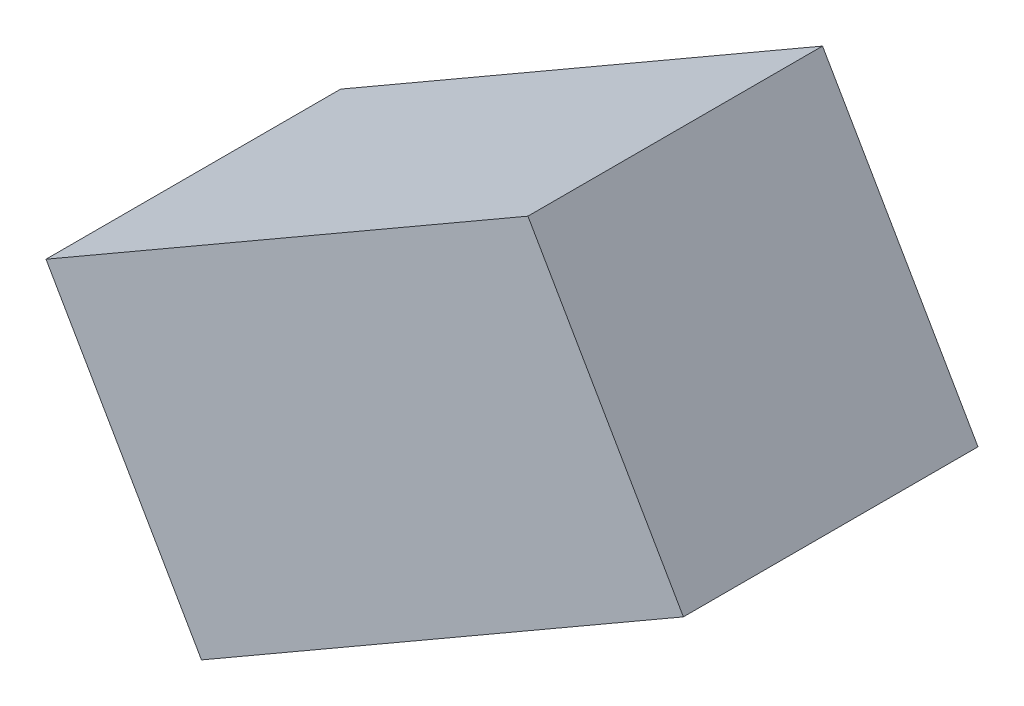
ISO-10303-21;
HEADER;
FILE_DESCRIPTION(('STEP AP214'),'2;1');
FILE_NAME('part.step','',(''),(''),'','','');
FILE_SCHEMA(('AUTOMOTIVE_DESIGN { 1 0 10303 214 1 1 1 1 }'));
ENDSEC;
DATA;
#1=APPLICATION_CONTEXT('core data for automotive mechanical design processes');
#2=APPLICATION_PROTOCOL_DEFINITION('international standard','automotive_design',2000,#1);
#3=PRODUCT_CONTEXT('',#1,'mechanical');
#4=PRODUCT('Part','Part','',(#3));
#5=PRODUCT_RELATED_PRODUCT_CATEGORY('part','',(#4));
#6=PRODUCT_DEFINITION_FORMATION('','',#4);
#7=PRODUCT_DEFINITION_CONTEXT('part definition',#1,'design');
#8=PRODUCT_DEFINITION('design','',#6,#7);
#9=PRODUCT_DEFINITION_SHAPE('','',#8);
#10=(LENGTH_UNIT() NAMED_UNIT(*) SI_UNIT(.MILLI.,.METRE.));
#11=(NAMED_UNIT(*) PLANE_ANGLE_UNIT() SI_UNIT($,.RADIAN.));
#12=(NAMED_UNIT(*) SI_UNIT($,.STERADIAN.) SOLID_ANGLE_UNIT());
#13=UNCERTAINTY_MEASURE_WITH_UNIT(LENGTH_MEASURE(1.E-05),#10,'distance_accuracy_value','');
#14=(GEOMETRIC_REPRESENTATION_CONTEXT(3) GLOBAL_UNCERTAINTY_ASSIGNED_CONTEXT((#13)) GLOBAL_UNIT_ASSIGNED_CONTEXT((#10,
#11,#12)) REPRESENTATION_CONTEXT('',''));
#15=CARTESIAN_POINT('',(0.,0.,0.));
#16=DIRECTION('',(0.,0.,1.));
#17=DIRECTION('',(1.,0.,0.));
#18=AXIS2_PLACEMENT_3D('',#15,#16,#17);
#19=CARTESIAN_POINT('',(-0.49862232,-0.83636104,0.90000074));
#20=DIRECTION('',(0.,0.,-1.));
#21=DIRECTION('',(-1.,0.,0.));
#22=AXIS2_PLACEMENT_3D('',#19,#20,#21);
#23=PLANE('',#22);
#24=DIRECTION('',(0.500000413801082,-0.866025164876141,0.));
#25=VECTOR('',#24,1.);
#26=CARTESIAN_POINT('',(0.97362264,0.01363979999999,0.90000074));
#27=LINE('',#26,#25);
#28=CARTESIAN_POINT('',(0.973622640000073,0.0136397999998627,0.90000074));
#29=VERTEX_POINT('',#28);
#30=CARTESIAN_POINT('',(0.498622320000048,0.836363580000028,0.90000074));
#31=VERTEX_POINT('',#30);
#32=EDGE_CURVE('E54',#29,#31,#27,.F.);
#33=ORIENTED_EDGE('',*,*,#32,.T.);
#34=DIRECTION('',(0.86602507711416,0.500000565809093,0.));
#35=VECTOR('',#34,1.);
#36=CARTESIAN_POINT('',(0.49862232,0.83636358,0.90000074));
#37=LINE('',#36,#35);
#38=CARTESIAN_POINT('',(-0.973620099999994,-0.0136372600000101,0.90000074));
#39=VERTEX_POINT('',#38);
#40=EDGE_CURVE('E56',#31,#39,#37,.F.);
#41=ORIENTED_EDGE('',*,*,#40,.T.);
#42=DIRECTION('',(-0.499998408535102,0.866026322615176,0.));
#43=VECTOR('',#42,1.);
#44=CARTESIAN_POINT('',(-0.9736201,-0.01363726,0.90000074));
#45=LINE('',#44,#43);
#46=CARTESIAN_POINT('',(-0.498622319999909,-0.836361039999947,0.90000074));
#47=VERTEX_POINT('',#46);
#48=EDGE_CURVE('E19',#39,#47,#45,.F.);
#49=ORIENTED_EDGE('',*,*,#48,.T.);
#50=DIRECTION('',(-0.866025450643935,-0.499999918836963,0.));
#51=VECTOR('',#50,1.);
#52=CARTESIAN_POINT('',(-0.49862232,-0.83636104,0.90000074));
#53=LINE('',#52,#51);
#54=EDGE_CURVE('E79',#47,#29,#53,.F.);
#55=ORIENTED_EDGE('',*,*,#54,.T.);
#56=EDGE_LOOP('',(#33,#41,#49,#55));
#57=FACE_BOUND('',#56,.T.);
#58=ADVANCED_FACE('F16',(#57),#23,.F.);
#59=CARTESIAN_POINT('',(-0.9736201,-0.01363726,0.));
#60=DIRECTION('',(0.866026322615176,0.499998408535102,0.));
#61=DIRECTION('',(-0.499998408535102,0.866026322615176,0.));
#62=AXIS2_PLACEMENT_3D('',#59,#60,#61);
#63=PLANE('',#62);
#64=DIRECTION('',(0.,0.,1.));
#65=VECTOR('',#64,1.);
#66=CARTESIAN_POINT('',(-0.49862232,-0.83636104,0.));
#67=LINE('',#66,#65);
#68=CARTESIAN_POINT('',(-0.498622319999909,-0.836361039999947,0.));
#69=VERTEX_POINT('',#68);
#70=EDGE_CURVE('E67',#69,#47,#67,.T.);
#71=ORIENTED_EDGE('',*,*,#70,.T.);
#72=ORIENTED_EDGE('',*,*,#48,.F.);
#73=DIRECTION('',(0.,0.,1.));
#74=VECTOR('',#73,1.);
#75=CARTESIAN_POINT('',(-0.973620099999977,-0.0136372600000406,0.));
#76=LINE('',#75,#74);
#77=CARTESIAN_POINT('',(-0.973620099999994,-0.0136372600000101,0.));
#78=VERTEX_POINT('',#77);
#79=EDGE_CURVE('E62',#39,#78,#76,.F.);
#80=ORIENTED_EDGE('',*,*,#79,.T.);
#81=DIRECTION('',(-0.49999840853491,0.866026322615287,0.));
#82=VECTOR('',#81,1.);
#83=CARTESIAN_POINT('',(-0.49862232,-0.83636104,0.));
#84=LINE('',#83,#82);
#85=EDGE_CURVE('E82',#69,#78,#84,.T.);
#86=ORIENTED_EDGE('',*,*,#85,.F.);
#87=EDGE_LOOP('',(#71,#72,#80,#86));
#88=FACE_BOUND('',#87,.T.);
#89=ADVANCED_FACE('F64',(#88),#63,.F.);
#90=CARTESIAN_POINT('',(0.49862232,0.83636358,0.));
#91=DIRECTION('',(0.500000565809093,-0.86602507711416,0.));
#92=DIRECTION('',(0.86602507711416,0.500000565809093,0.));
#93=AXIS2_PLACEMENT_3D('',#90,#91,#92);
#94=PLANE('',#93);
#95=ORIENTED_EDGE('',*,*,#79,.F.);
#96=ORIENTED_EDGE('',*,*,#40,.F.);
#97=DIRECTION('',(0.,0.,1.));
#98=VECTOR('',#97,1.);
#99=CARTESIAN_POINT('',(0.498622320000195,0.836363580000112,0.));
#100=LINE('',#99,#98);
#101=CARTESIAN_POINT('',(0.498622320000049,0.836363580000028,0.));
#102=VERTEX_POINT('',#101);
#103=EDGE_CURVE('E74',#31,#102,#100,.F.);
#104=ORIENTED_EDGE('',*,*,#103,.T.);
#105=DIRECTION('',(0.866025077114174,0.500000565809069,0.));
#106=VECTOR('',#105,1.);
#107=CARTESIAN_POINT('',(-0.9736201,-0.01363726,0.));
#108=LINE('',#107,#106);
#109=EDGE_CURVE('E71',#78,#102,#108,.T.);
#110=ORIENTED_EDGE('',*,*,#109,.F.);
#111=EDGE_LOOP('',(#95,#96,#104,#110));
#112=FACE_BOUND('',#111,.T.);
#113=ADVANCED_FACE('F69',(#112),#94,.F.);
#114=CARTESIAN_POINT('',(0.97362264,0.01363979999999,0.));
#115=DIRECTION('',(-0.866025164876141,-0.500000413801082,0.));
#116=DIRECTION('',(0.500000413801082,-0.866025164876141,0.));
#117=AXIS2_PLACEMENT_3D('',#114,#115,#116);
#118=PLANE('',#117);
#119=ORIENTED_EDGE('',*,*,#103,.F.);
#120=ORIENTED_EDGE('',*,*,#32,.F.);
#121=DIRECTION('',(0.,0.,1.));
#122=VECTOR('',#121,1.);
#123=CARTESIAN_POINT('',(0.973622640000294,0.0136397999994812,0.));
#124=LINE('',#123,#122);
#125=CARTESIAN_POINT('',(0.973622640000073,0.0136397999998628,0.));
#126=VERTEX_POINT('',#125);
#127=EDGE_CURVE('E34',#29,#126,#124,.F.);
#128=ORIENTED_EDGE('',*,*,#127,.T.);
#129=DIRECTION('',(0.500000413801286,-0.866025164876023,0.));
#130=VECTOR('',#129,1.);
#131=CARTESIAN_POINT('',(0.49862232,0.83636358,0.));
#132=LINE('',#131,#130);
#133=EDGE_CURVE('E25',#102,#126,#132,.T.);
#134=ORIENTED_EDGE('',*,*,#133,.F.);
#135=EDGE_LOOP('',(#119,#120,#128,#134));
#136=FACE_BOUND('',#135,.T.);
#137=ADVANCED_FACE('F88',(#136),#118,.F.);
#138=CARTESIAN_POINT('',(-0.49862232,-0.83636104,0.));
#139=DIRECTION('',(-0.499999918836963,0.866025450643935,0.));
#140=DIRECTION('',(-0.866025450643935,-0.499999918836963,0.));
#141=AXIS2_PLACEMENT_3D('',#138,#139,#140);
#142=PLANE('',#141);
#143=ORIENTED_EDGE('',*,*,#127,.F.);
#144=ORIENTED_EDGE('',*,*,#54,.F.);
#145=ORIENTED_EDGE('',*,*,#70,.F.);
#146=DIRECTION('',(-0.866025450643762,-0.499999918837262,0.));
#147=VECTOR('',#146,1.);
#148=CARTESIAN_POINT('',(0.97362264,0.0136397999999901,0.));
#149=LINE('',#148,#147);
#150=EDGE_CURVE('E11',#126,#69,#149,.T.);
#151=ORIENTED_EDGE('',*,*,#150,.F.);
#152=EDGE_LOOP('',(#143,#144,#145,#151));
#153=FACE_BOUND('',#152,.T.);
#154=ADVANCED_FACE('F90',(#153),#142,.F.);
#155=CARTESIAN_POINT('',(-0.49862232,-0.83636104,0.));
#156=DIRECTION('',(0.,0.,-1.));
#157=DIRECTION('',(-1.,0.,0.));
#158=AXIS2_PLACEMENT_3D('',#155,#156,#157);
#159=PLANE('',#158);
#160=ORIENTED_EDGE('',*,*,#133,.T.);
#161=ORIENTED_EDGE('',*,*,#150,.T.);
#162=ORIENTED_EDGE('',*,*,#85,.T.);
#163=ORIENTED_EDGE('',*,*,#109,.T.);
#164=EDGE_LOOP('',(#160,#161,#162,#163));
#165=FACE_BOUND('',#164,.T.);
#166=ADVANCED_FACE('F87',(#165),#159,.T.);
#167=CLOSED_SHELL('',(#58,#89,#113,#137,#154,#166));
#168=MANIFOLD_SOLID_BREP('B1',#167);
#169=ADVANCED_BREP_SHAPE_REPRESENTATION('',(#18,#168),#14);
#170=SHAPE_DEFINITION_REPRESENTATION(#9,#169);
ENDSEC;
END-ISO-10303-21;
